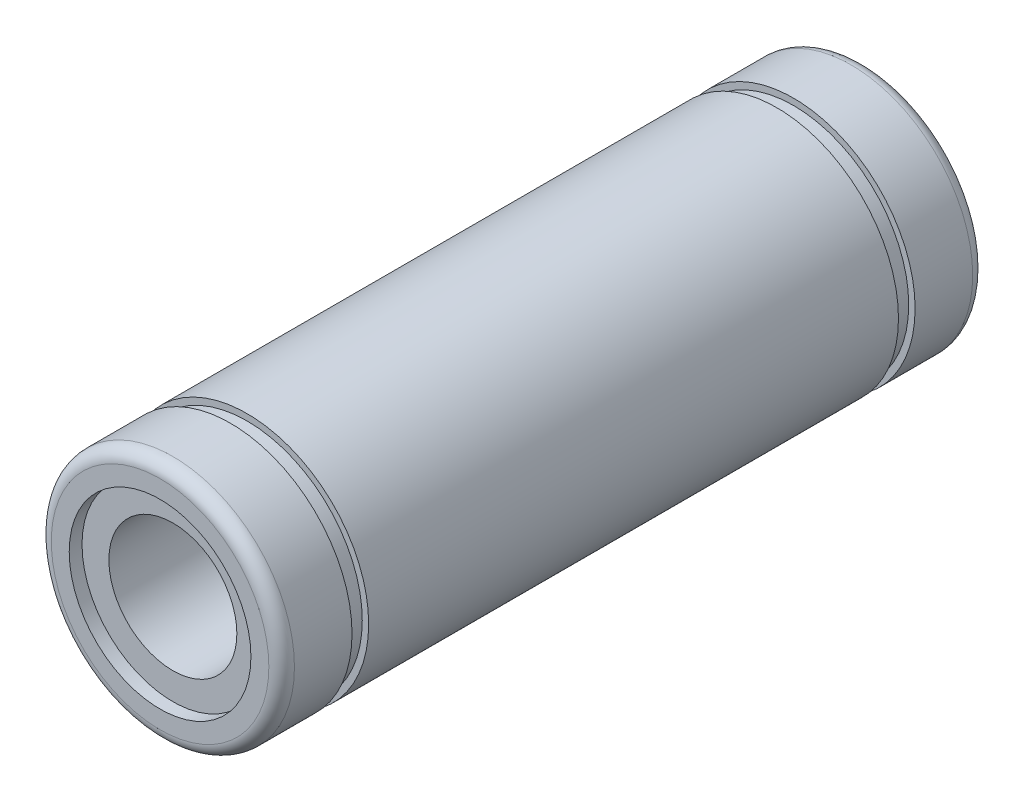
ISO-10303-21;
HEADER;
FILE_DESCRIPTION(('STEP AP214'),'2;1');
FILE_NAME('part.step','',(''),(''),'','','');
FILE_SCHEMA(('AUTOMOTIVE_DESIGN { 1 0 10303 214 1 1 1 1 }'));
ENDSEC;
DATA;
#1=APPLICATION_CONTEXT('core data for automotive mechanical design processes');
#2=APPLICATION_PROTOCOL_DEFINITION('international standard','automotive_design',2000,#1);
#3=PRODUCT_CONTEXT('',#1,'mechanical');
#4=PRODUCT('Part','Part','',(#3));
#5=PRODUCT_RELATED_PRODUCT_CATEGORY('part','',(#4));
#6=PRODUCT_DEFINITION_FORMATION('','',#4);
#7=PRODUCT_DEFINITION_CONTEXT('part definition',#1,'design');
#8=PRODUCT_DEFINITION('design','',#6,#7);
#9=PRODUCT_DEFINITION_SHAPE('','',#8);
#10=(LENGTH_UNIT() NAMED_UNIT(*) SI_UNIT(.MILLI.,.METRE.));
#11=(NAMED_UNIT(*) PLANE_ANGLE_UNIT() SI_UNIT($,.RADIAN.));
#12=(NAMED_UNIT(*) SI_UNIT($,.STERADIAN.) SOLID_ANGLE_UNIT());
#13=UNCERTAINTY_MEASURE_WITH_UNIT(LENGTH_MEASURE(1.E-05),#10,'distance_accuracy_value','');
#14=(GEOMETRIC_REPRESENTATION_CONTEXT(3) GLOBAL_UNCERTAINTY_ASSIGNED_CONTEXT((#13)) GLOBAL_UNIT_ASSIGNED_CONTEXT((#10,
#11,#12)) REPRESENTATION_CONTEXT('',''));
#15=CARTESIAN_POINT('',(0.,0.,0.));
#16=DIRECTION('',(0.,0.,1.));
#17=DIRECTION('',(1.,0.,0.));
#18=AXIS2_PLACEMENT_3D('',#15,#16,#17);
#19=CARTESIAN_POINT('',(0.,0.,55.));
#20=DIRECTION('',(0.,0.,-1.));
#21=DIRECTION('',(-1.,0.,0.));
#22=AXIS2_PLACEMENT_3D('',#19,#20,#21);
#23=CYLINDRICAL_SURFACE('',#22,9.5);
#24=CARTESIAN_POINT('',(0.,0.,6.80000000000001));
#25=DIRECTION('',(0.,0.,-1.));
#26=DIRECTION('',(-1.,0.,0.));
#27=AXIS2_PLACEMENT_3D('',#24,#25,#26);
#28=CIRCLE('',#27,9.5);
#29=CARTESIAN_POINT('',(-9.5,0.,6.80000000000001));
#30=VERTEX_POINT('',#29);
#31=EDGE_CURVE('E83',#30,#30,#28,.T.);
#32=ORIENTED_EDGE('',*,*,#31,.F.);
#33=EDGE_LOOP('',(#32));
#34=FACE_BOUND('',#33,.T.);
#35=CARTESIAN_POINT('',(0.,0.,48.2));
#36=DIRECTION('',(0.,0.,-1.));
#37=DIRECTION('',(-1.,0.,0.));
#38=AXIS2_PLACEMENT_3D('',#35,#36,#37);
#39=CIRCLE('',#38,9.5);
#40=CARTESIAN_POINT('',(-9.5,0.,48.2));
#41=VERTEX_POINT('',#40);
#42=EDGE_CURVE('E69',#41,#41,#39,.T.);
#43=ORIENTED_EDGE('',*,*,#42,.T.);
#44=EDGE_LOOP('',(#43));
#45=FACE_BOUND('',#44,.T.);
#46=ADVANCED_FACE('F33',(#34,#45),#23,.T.);
#47=CARTESIAN_POINT('',(0.,0.,1.));
#48=DIRECTION('',(0.,0.,1.));
#49=DIRECTION('',(1.,0.,0.));
#50=AXIS2_PLACEMENT_3D('',#47,#48,#49);
#51=CIRCLE('',#50,9.5);
#52=CARTESIAN_POINT('',(9.5,0.,1.));
#53=VERTEX_POINT('',#52);
#54=EDGE_CURVE('E40',#53,#53,#51,.T.);
#55=ORIENTED_EDGE('',*,*,#54,.T.);
#56=EDGE_LOOP('',(#55));
#57=FACE_BOUND('',#56,.T.);
#58=CARTESIAN_POINT('',(0.,0.,5.5));
#59=DIRECTION('',(0.,0.,-1.));
#60=DIRECTION('',(-1.,0.,0.));
#61=AXIS2_PLACEMENT_3D('',#58,#59,#60);
#62=CIRCLE('',#61,9.5);
#63=CARTESIAN_POINT('',(-9.5,0.,5.5));
#64=VERTEX_POINT('',#63);
#65=EDGE_CURVE('E92',#64,#64,#62,.T.);
#66=ORIENTED_EDGE('',*,*,#65,.T.);
#67=EDGE_LOOP('',(#66));
#68=FACE_BOUND('',#67,.T.);
#69=ADVANCED_FACE('F96',(#57,#68),#23,.T.);
#70=CARTESIAN_POINT('',(0.,0.,55.));
#71=DIRECTION('',(0.,0.,-1.));
#72=DIRECTION('',(-1.,0.,0.));
#73=AXIS2_PLACEMENT_3D('',#70,#71,#72);
#74=CYLINDRICAL_SURFACE('',#73,5.);
#75=CARTESIAN_POINT('',(0.,0.,54.));
#76=DIRECTION('',(0.,0.,1.));
#77=DIRECTION('',(1.,0.,0.));
#78=AXIS2_PLACEMENT_3D('',#75,#76,#77);
#79=CIRCLE('',#78,5.);
#80=CARTESIAN_POINT('',(5.,0.,54.));
#81=VERTEX_POINT('',#80);
#82=EDGE_CURVE('E53',#81,#81,#79,.T.);
#83=ORIENTED_EDGE('',*,*,#82,.T.);
#84=EDGE_LOOP('',(#83));
#85=FACE_BOUND('',#84,.T.);
#86=CARTESIAN_POINT('',(0.,0.,1.));
#87=DIRECTION('',(0.,0.,-1.));
#88=DIRECTION('',(-1.,0.,0.));
#89=AXIS2_PLACEMENT_3D('',#86,#87,#88);
#90=CIRCLE('',#89,5.);
#91=CARTESIAN_POINT('',(-5.,0.,1.));
#92=VERTEX_POINT('',#91);
#93=EDGE_CURVE('E54',#92,#92,#90,.T.);
#94=ORIENTED_EDGE('',*,*,#93,.T.);
#95=EDGE_LOOP('',(#94));
#96=FACE_BOUND('',#95,.T.);
#97=ADVANCED_FACE('F156',(#85,#96),#74,.F.);
#98=CARTESIAN_POINT('',(0.,0.,55.));
#99=DIRECTION('',(0.,0.,1.));
#100=DIRECTION('',(1.,0.,0.));
#101=AXIS2_PLACEMENT_3D('',#98,#99,#100);
#102=PLANE('',#101);
#103=CARTESIAN_POINT('',(0.,0.,55.));
#104=DIRECTION('',(0.,0.,1.));
#105=DIRECTION('',(1.,0.,0.));
#106=AXIS2_PLACEMENT_3D('',#103,#104,#105);
#107=CIRCLE('',#106,8.5);
#108=CARTESIAN_POINT('',(8.5,0.,55.));
#109=VERTEX_POINT('',#108);
#110=EDGE_CURVE('E48',#109,#109,#107,.T.);
#111=ORIENTED_EDGE('',*,*,#110,.T.);
#112=EDGE_LOOP('',(#111));
#113=FACE_BOUND('',#112,.T.);
#114=CARTESIAN_POINT('',(0.,0.,55.));
#115=DIRECTION('',(0.,0.,1.));
#116=DIRECTION('',(1.,0.,0.));
#117=AXIS2_PLACEMENT_3D('',#114,#115,#116);
#118=CIRCLE('',#117,7.1);
#119=CARTESIAN_POINT('',(7.1,0.,55.));
#120=VERTEX_POINT('',#119);
#121=EDGE_CURVE('E57',#120,#120,#118,.T.);
#122=ORIENTED_EDGE('',*,*,#121,.F.);
#123=EDGE_LOOP('',(#122));
#124=FACE_BOUND('',#123,.T.);
#125=ADVANCED_FACE('F153',(#113,#124),#102,.T.);
#126=CARTESIAN_POINT('',(0.,0.,0.));
#127=DIRECTION('',(0.,0.,1.));
#128=DIRECTION('',(1.,0.,0.));
#129=AXIS2_PLACEMENT_3D('',#126,#127,#128);
#130=PLANE('',#129);
#131=CARTESIAN_POINT('',(0.,0.,0.));
#132=DIRECTION('',(0.,0.,1.));
#133=DIRECTION('',(1.,0.,0.));
#134=AXIS2_PLACEMENT_3D('',#131,#132,#133);
#135=CIRCLE('',#134,8.5);
#136=CARTESIAN_POINT('',(8.5,0.,0.));
#137=VERTEX_POINT('',#136);
#138=EDGE_CURVE('E10',#137,#137,#135,.F.);
#139=ORIENTED_EDGE('',*,*,#138,.T.);
#140=EDGE_LOOP('',(#139));
#141=FACE_BOUND('',#140,.T.);
#142=CARTESIAN_POINT('',(0.,0.,0.));
#143=DIRECTION('',(0.,0.,-1.));
#144=DIRECTION('',(-1.,0.,0.));
#145=AXIS2_PLACEMENT_3D('',#142,#143,#144);
#146=CIRCLE('',#145,7.1);
#147=CARTESIAN_POINT('',(-7.1,0.,0.));
#148=VERTEX_POINT('',#147);
#149=EDGE_CURVE('E66',#148,#148,#146,.T.);
#150=ORIENTED_EDGE('',*,*,#149,.F.);
#151=EDGE_LOOP('',(#150));
#152=FACE_BOUND('',#151,.T.);
#153=ADVANCED_FACE('F144',(#141,#152),#130,.F.);
#154=CARTESIAN_POINT('',(0.,0.,54.));
#155=DIRECTION('',(0.,0.,1.));
#156=DIRECTION('',(1.,0.,0.));
#157=AXIS2_PLACEMENT_3D('',#154,#155,#156);
#158=CIRCLE('',#157,9.5);
#159=CARTESIAN_POINT('',(9.5,0.,54.));
#160=VERTEX_POINT('',#159);
#161=EDGE_CURVE('E44',#160,#160,#158,.F.);
#162=ORIENTED_EDGE('',*,*,#161,.T.);
#163=EDGE_LOOP('',(#162));
#164=FACE_BOUND('',#163,.T.);
#165=CARTESIAN_POINT('',(0.,0.,49.5));
#166=DIRECTION('',(0.,0.,-1.));
#167=DIRECTION('',(-1.,0.,0.));
#168=AXIS2_PLACEMENT_3D('',#165,#166,#167);
#169=CIRCLE('',#168,9.5);
#170=CARTESIAN_POINT('',(-9.5,0.,49.5));
#171=VERTEX_POINT('',#170);
#172=EDGE_CURVE('E80',#171,#171,#169,.T.);
#173=ORIENTED_EDGE('',*,*,#172,.F.);
#174=EDGE_LOOP('',(#173));
#175=FACE_BOUND('',#174,.T.);
#176=ADVANCED_FACE('F121',(#164,#175),#23,.T.);
#177=CARTESIAN_POINT('',(0.,0.,54.));
#178=DIRECTION('',(0.,0.,1.));
#179=DIRECTION('',(1.,0.,0.));
#180=AXIS2_PLACEMENT_3D('',#177,#178,#179);
#181=CYLINDRICAL_SURFACE('',#180,7.1);
#182=CARTESIAN_POINT('',(0.,0.,54.));
#183=DIRECTION('',(0.,0.,1.));
#184=DIRECTION('',(1.,0.,0.));
#185=AXIS2_PLACEMENT_3D('',#182,#183,#184);
#186=CIRCLE('',#185,7.1);
#187=CARTESIAN_POINT('',(7.1,0.,54.));
#188=VERTEX_POINT('',#187);
#189=EDGE_CURVE('E61',#188,#188,#186,.T.);
#190=ORIENTED_EDGE('',*,*,#189,.F.);
#191=EDGE_LOOP('',(#190));
#192=FACE_BOUND('',#191,.T.);
#193=ORIENTED_EDGE('',*,*,#121,.T.);
#194=EDGE_LOOP('',(#193));
#195=FACE_BOUND('',#194,.T.);
#196=ADVANCED_FACE('F143',(#192,#195),#181,.F.);
#197=CARTESIAN_POINT('',(0.,0.,54.));
#198=DIRECTION('',(0.,0.,1.));
#199=DIRECTION('',(1.,0.,0.));
#200=AXIS2_PLACEMENT_3D('',#197,#198,#199);
#201=PLANE('',#200);
#202=ORIENTED_EDGE('',*,*,#82,.F.);
#203=EDGE_LOOP('',(#202));
#204=FACE_BOUND('',#203,.T.);
#205=ORIENTED_EDGE('',*,*,#189,.T.);
#206=EDGE_LOOP('',(#205));
#207=FACE_BOUND('',#206,.T.);
#208=ADVANCED_FACE('F150',(#204,#207),#201,.T.);
#209=CARTESIAN_POINT('',(0.,0.,1.));
#210=DIRECTION('',(0.,0.,-1.));
#211=DIRECTION('',(-1.,0.,0.));
#212=AXIS2_PLACEMENT_3D('',#209,#210,#211);
#213=CYLINDRICAL_SURFACE('',#212,7.1);
#214=CARTESIAN_POINT('',(0.,0.,1.));
#215=DIRECTION('',(0.,0.,-1.));
#216=DIRECTION('',(-1.,0.,0.));
#217=AXIS2_PLACEMENT_3D('',#214,#215,#216);
#218=CIRCLE('',#217,7.1);
#219=CARTESIAN_POINT('',(-7.1,0.,1.));
#220=VERTEX_POINT('',#219);
#221=EDGE_CURVE('E58',#220,#220,#218,.T.);
#222=ORIENTED_EDGE('',*,*,#221,.F.);
#223=EDGE_LOOP('',(#222));
#224=FACE_BOUND('',#223,.T.);
#225=ORIENTED_EDGE('',*,*,#149,.T.);
#226=EDGE_LOOP('',(#225));
#227=FACE_BOUND('',#226,.T.);
#228=ADVANCED_FACE('F171',(#224,#227),#213,.F.);
#229=CARTESIAN_POINT('',(0.,0.,1.));
#230=DIRECTION('',(0.,0.,-1.));
#231=DIRECTION('',(-1.,0.,0.));
#232=AXIS2_PLACEMENT_3D('',#229,#230,#231);
#233=PLANE('',#232);
#234=ORIENTED_EDGE('',*,*,#93,.F.);
#235=EDGE_LOOP('',(#234));
#236=FACE_BOUND('',#235,.T.);
#237=ORIENTED_EDGE('',*,*,#221,.T.);
#238=EDGE_LOOP('',(#237));
#239=FACE_BOUND('',#238,.T.);
#240=ADVANCED_FACE('F128',(#236,#239),#233,.T.);
#241=CARTESIAN_POINT('',(-9.5,0.,48.2));
#242=DIRECTION('',(0.,0.,-1.));
#243=DIRECTION('',(-1.,0.,0.));
#244=AXIS2_PLACEMENT_3D('',#241,#242,#243);
#245=PLANE('',#244);
#246=ORIENTED_EDGE('',*,*,#42,.F.);
#247=EDGE_LOOP('',(#246));
#248=FACE_BOUND('',#247,.T.);
#249=CARTESIAN_POINT('',(0.,0.,48.2));
#250=DIRECTION('',(0.,0.,-1.));
#251=DIRECTION('',(-1.,0.,0.));
#252=AXIS2_PLACEMENT_3D('',#249,#250,#251);
#253=CIRCLE('',#252,8.99999999999999);
#254=CARTESIAN_POINT('',(-8.99999999999999,0.,48.2));
#255=VERTEX_POINT('',#254);
#256=EDGE_CURVE('E74',#255,#255,#253,.T.);
#257=ORIENTED_EDGE('',*,*,#256,.T.);
#258=EDGE_LOOP('',(#257));
#259=FACE_BOUND('',#258,.T.);
#260=ADVANCED_FACE('F124',(#248,#259),#245,.F.);
#261=CARTESIAN_POINT('',(0.,0.,0.));
#262=DIRECTION('',(0.,0.,-1.));
#263=DIRECTION('',(-1.,0.,0.));
#264=AXIS2_PLACEMENT_3D('',#261,#262,#263);
#265=CYLINDRICAL_SURFACE('',#264,8.99999999999999);
#266=ORIENTED_EDGE('',*,*,#256,.F.);
#267=EDGE_LOOP('',(#266));
#268=FACE_BOUND('',#267,.T.);
#269=CARTESIAN_POINT('',(0.,0.,49.5));
#270=DIRECTION('',(0.,0.,-1.));
#271=DIRECTION('',(-1.,0.,0.));
#272=AXIS2_PLACEMENT_3D('',#269,#270,#271);
#273=CIRCLE('',#272,8.99999999999999);
#274=CARTESIAN_POINT('',(-8.99999999999999,0.,49.5));
#275=VERTEX_POINT('',#274);
#276=EDGE_CURVE('E77',#275,#275,#273,.T.);
#277=ORIENTED_EDGE('',*,*,#276,.T.);
#278=EDGE_LOOP('',(#277));
#279=FACE_BOUND('',#278,.T.);
#280=ADVANCED_FACE('F127',(#268,#279),#265,.T.);
#281=CARTESIAN_POINT('',(-9.5,0.,49.5));
#282=DIRECTION('',(0.,0.,1.));
#283=DIRECTION('',(1.,0.,0.));
#284=AXIS2_PLACEMENT_3D('',#281,#282,#283);
#285=PLANE('',#284);
#286=ORIENTED_EDGE('',*,*,#276,.F.);
#287=EDGE_LOOP('',(#286));
#288=FACE_BOUND('',#287,.T.);
#289=ORIENTED_EDGE('',*,*,#172,.T.);
#290=EDGE_LOOP('',(#289));
#291=FACE_BOUND('',#290,.T.);
#292=ADVANCED_FACE('F114',(#288,#291),#285,.F.);
#293=CARTESIAN_POINT('',(-9.5,0.,6.80000000000001));
#294=DIRECTION('',(0.,0.,1.));
#295=DIRECTION('',(1.,0.,0.));
#296=AXIS2_PLACEMENT_3D('',#293,#294,#295);
#297=PLANE('',#296);
#298=CARTESIAN_POINT('',(0.,0.,6.80000000000001));
#299=DIRECTION('',(0.,0.,-1.));
#300=DIRECTION('',(-1.,0.,0.));
#301=AXIS2_PLACEMENT_3D('',#298,#299,#300);
#302=CIRCLE('',#301,8.99999999999999);
#303=CARTESIAN_POINT('',(-8.99999999999999,0.,6.80000000000001));
#304=VERTEX_POINT('',#303);
#305=EDGE_CURVE('E86',#304,#304,#302,.T.);
#306=ORIENTED_EDGE('',*,*,#305,.F.);
#307=EDGE_LOOP('',(#306));
#308=FACE_BOUND('',#307,.T.);
#309=ORIENTED_EDGE('',*,*,#31,.T.);
#310=EDGE_LOOP('',(#309));
#311=FACE_BOUND('',#310,.T.);
#312=ADVANCED_FACE('F108',(#308,#311),#297,.F.);
#313=CARTESIAN_POINT('',(0.,0.,0.));
#314=DIRECTION('',(0.,0.,-1.));
#315=DIRECTION('',(-1.,0.,0.));
#316=AXIS2_PLACEMENT_3D('',#313,#314,#315);
#317=CYLINDRICAL_SURFACE('',#316,9.);
#318=CARTESIAN_POINT('',(0.,0.,5.5));
#319=DIRECTION('',(0.,0.,-1.));
#320=DIRECTION('',(-1.,0.,0.));
#321=AXIS2_PLACEMENT_3D('',#318,#319,#320);
#322=CIRCLE('',#321,9.);
#323=CARTESIAN_POINT('',(-9.,0.,5.5));
#324=VERTEX_POINT('',#323);
#325=EDGE_CURVE('E89',#324,#324,#322,.T.);
#326=ORIENTED_EDGE('',*,*,#325,.F.);
#327=EDGE_LOOP('',(#326));
#328=FACE_BOUND('',#327,.T.);
#329=ORIENTED_EDGE('',*,*,#305,.T.);
#330=EDGE_LOOP('',(#329));
#331=FACE_BOUND('',#330,.T.);
#332=ADVANCED_FACE('F102',(#328,#331),#317,.T.);
#333=CARTESIAN_POINT('',(-9.5,0.,5.5));
#334=DIRECTION('',(0.,0.,-1.));
#335=DIRECTION('',(-1.,0.,0.));
#336=AXIS2_PLACEMENT_3D('',#333,#334,#335);
#337=PLANE('',#336);
#338=ORIENTED_EDGE('',*,*,#65,.F.);
#339=EDGE_LOOP('',(#338));
#340=FACE_BOUND('',#339,.T.);
#341=ORIENTED_EDGE('',*,*,#325,.T.);
#342=EDGE_LOOP('',(#341));
#343=FACE_BOUND('',#342,.T.);
#344=ADVANCED_FACE('F98',(#340,#343),#337,.F.);
#345=CARTESIAN_POINT('',(0.,0.,54.));
#346=DIRECTION('',(0.,0.,1.));
#347=DIRECTION('',(1.,0.,0.));
#348=AXIS2_PLACEMENT_3D('',#345,#346,#347);
#349=TOROIDAL_SURFACE('',#348,8.5,1.);
#350=ORIENTED_EDGE('',*,*,#161,.F.);
#351=EDGE_LOOP('',(#350));
#352=FACE_BOUND('',#351,.T.);
#353=ORIENTED_EDGE('',*,*,#110,.F.);
#354=EDGE_LOOP('',(#353));
#355=FACE_BOUND('',#354,.T.);
#356=ADVANCED_FACE('F101',(#352,#355),#349,.T.);
#357=CARTESIAN_POINT('',(0.,0.,1.));
#358=DIRECTION('',(0.,0.,1.));
#359=DIRECTION('',(1.,0.,0.));
#360=AXIS2_PLACEMENT_3D('',#357,#358,#359);
#361=TOROIDAL_SURFACE('',#360,8.5,1.);
#362=ORIENTED_EDGE('',*,*,#138,.F.);
#363=EDGE_LOOP('',(#362));
#364=FACE_BOUND('',#363,.T.);
#365=ORIENTED_EDGE('',*,*,#54,.F.);
#366=EDGE_LOOP('',(#365));
#367=FACE_BOUND('',#366,.T.);
#368=ADVANCED_FACE('F35',(#364,#367),#361,.T.);
#369=CLOSED_SHELL('',(#46,#69,#97,#125,#153,#176,#196,#208,#228,#240,#260,#280,#292,#312,#332,
#344,#356,#368));
#370=MANIFOLD_SOLID_BREP('B2',#369);
#371=ADVANCED_BREP_SHAPE_REPRESENTATION('',(#18,#370),#14);
#372=SHAPE_DEFINITION_REPRESENTATION(#9,#371);
ENDSEC;
END-ISO-10303-21;
